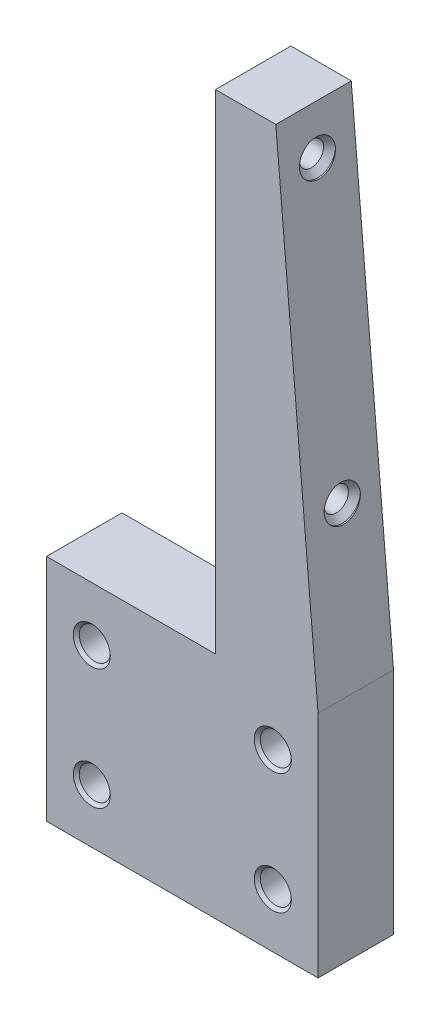
ISO-10303-21;
HEADER;
FILE_DESCRIPTION(('STEP AP214'),'2;1');
FILE_NAME('part.step','',(''),(''),'','','');
FILE_SCHEMA(('AUTOMOTIVE_DESIGN { 1 0 10303 214 1 1 1 1 }'));
ENDSEC;
DATA;
#1=APPLICATION_CONTEXT('core data for automotive mechanical design processes');
#2=APPLICATION_PROTOCOL_DEFINITION('international standard','automotive_design',2000,#1);
#3=PRODUCT_CONTEXT('',#1,'mechanical');
#4=PRODUCT('Part','Part','',(#3));
#5=PRODUCT_RELATED_PRODUCT_CATEGORY('part','',(#4));
#6=PRODUCT_DEFINITION_FORMATION('','',#4);
#7=PRODUCT_DEFINITION_CONTEXT('part definition',#1,'design');
#8=PRODUCT_DEFINITION('design','',#6,#7);
#9=PRODUCT_DEFINITION_SHAPE('','',#8);
#10=(LENGTH_UNIT() NAMED_UNIT(*) SI_UNIT(.MILLI.,.METRE.));
#11=(NAMED_UNIT(*) PLANE_ANGLE_UNIT() SI_UNIT($,.RADIAN.));
#12=(NAMED_UNIT(*) SI_UNIT($,.STERADIAN.) SOLID_ANGLE_UNIT());
#13=UNCERTAINTY_MEASURE_WITH_UNIT(LENGTH_MEASURE(1.E-05),#10,'distance_accuracy_value','');
#14=(GEOMETRIC_REPRESENTATION_CONTEXT(3) GLOBAL_UNCERTAINTY_ASSIGNED_CONTEXT((#13)) GLOBAL_UNIT_ASSIGNED_CONTEXT((#10,
#11,#12)) REPRESENTATION_CONTEXT('',''));
#15=CARTESIAN_POINT('',(0.,0.,0.));
#16=DIRECTION('',(0.,0.,1.));
#17=DIRECTION('',(1.,0.,0.));
#18=AXIS2_PLACEMENT_3D('',#15,#16,#17);
#19=CARTESIAN_POINT('',(0.,-1.27,7.9375));
#20=DIRECTION('',(0.,0.,-1.));
#21=DIRECTION('',(-1.,0.,0.));
#22=AXIS2_PLACEMENT_3D('',#19,#20,#21);
#23=PLANE('',#22);
#24=CARTESIAN_POINT('',(12.065,-12.7,7.9375));
#25=DIRECTION('',(0.,0.,1.));
#26=DIRECTION('',(1.,0.,0.));
#27=AXIS2_PLACEMENT_3D('',#24,#25,#26);
#28=CIRCLE('',#27,3.8989);
#29=CARTESIAN_POINT('',(15.9639,-12.7,7.9375));
#30=VERTEX_POINT('',#29);
#31=EDGE_CURVE('E201',#30,#30,#28,.T.);
#32=ORIENTED_EDGE('',*,*,#31,.F.);
#33=EDGE_LOOP('',(#32));
#34=FACE_BOUND('',#33,.T.);
#35=CARTESIAN_POINT('',(-26.035,-38.1,7.9375));
#36=DIRECTION('',(0.,0.,1.));
#37=DIRECTION('',(1.,0.,0.));
#38=AXIS2_PLACEMENT_3D('',#35,#36,#37);
#39=CIRCLE('',#38,3.8989);
#40=CARTESIAN_POINT('',(-22.1361,-38.1,7.9375));
#41=VERTEX_POINT('',#40);
#42=EDGE_CURVE('E225',#41,#41,#39,.T.);
#43=ORIENTED_EDGE('',*,*,#42,.F.);
#44=EDGE_LOOP('',(#43));
#45=FACE_BOUND('',#44,.T.);
#46=DIRECTION('',(0.,-1.,0.));
#47=VECTOR('',#46,1.);
#48=CARTESIAN_POINT('',(0.,101.6,7.9375));
#49=LINE('',#48,#47);
#50=CARTESIAN_POINT('',(0.,101.6,7.9375));
#51=VERTEX_POINT('',#50);
#52=CARTESIAN_POINT('',(0.,-1.27,7.9375));
#53=VERTEX_POINT('',#52);
#54=EDGE_CURVE('E146',#51,#53,#49,.T.);
#55=ORIENTED_EDGE('',*,*,#54,.T.);
#56=DIRECTION('',(-1.,0.,0.));
#57=VECTOR('',#56,1.);
#58=CARTESIAN_POINT('',(0.,-1.27,7.9375));
#59=LINE('',#58,#57);
#60=CARTESIAN_POINT('',(-35.56,-1.27,7.9375));
#61=VERTEX_POINT('',#60);
#62=EDGE_CURVE('E149',#53,#61,#59,.T.);
#63=ORIENTED_EDGE('',*,*,#62,.T.);
#64=DIRECTION('',(0.,-1.,0.));
#65=VECTOR('',#64,1.);
#66=CARTESIAN_POINT('',(-35.56,-1.27,7.9375));
#67=LINE('',#66,#65);
#68=CARTESIAN_POINT('',(-35.56,-49.53,7.9375));
#69=VERTEX_POINT('',#68);
#70=EDGE_CURVE('E235',#61,#69,#67,.T.);
#71=ORIENTED_EDGE('',*,*,#70,.T.);
#72=DIRECTION('',(1.,0.,0.));
#73=VECTOR('',#72,1.);
#74=CARTESIAN_POINT('',(-35.56,-49.53,7.9375));
#75=LINE('',#74,#73);
#76=CARTESIAN_POINT('',(21.59,-49.53,7.9375));
#77=VERTEX_POINT('',#76);
#78=EDGE_CURVE('E237',#69,#77,#75,.T.);
#79=ORIENTED_EDGE('',*,*,#78,.T.);
#80=DIRECTION('',(0.,1.,0.));
#81=VECTOR('',#80,1.);
#82=CARTESIAN_POINT('',(21.59,-49.53,7.9375));
#83=LINE('',#82,#81);
#84=CARTESIAN_POINT('',(21.59,-1.27,7.9375));
#85=VERTEX_POINT('',#84);
#86=EDGE_CURVE('E239',#77,#85,#83,.T.);
#87=ORIENTED_EDGE('',*,*,#86,.T.);
#88=DIRECTION('',(-0.0860988419783634,0.996286600035344,0.));
#89=VECTOR('',#88,1.);
#90=CARTESIAN_POINT('',(21.59,-1.27,7.9375));
#91=LINE('',#90,#89);
#92=CARTESIAN_POINT('',(12.7,101.6,7.9375));
#93=VERTEX_POINT('',#92);
#94=EDGE_CURVE('E241',#85,#93,#91,.T.);
#95=ORIENTED_EDGE('',*,*,#94,.T.);
#96=DIRECTION('',(-1.,0.,0.));
#97=VECTOR('',#96,1.);
#98=CARTESIAN_POINT('',(12.7,101.6,7.9375));
#99=LINE('',#98,#97);
#100=EDGE_CURVE('E139',#93,#51,#99,.T.);
#101=ORIENTED_EDGE('',*,*,#100,.T.);
#102=EDGE_LOOP('',(#55,#63,#71,#79,#87,#95,#101));
#103=FACE_BOUND('',#102,.T.);
#104=CARTESIAN_POINT('',(12.065,-38.1,7.9375));
#105=DIRECTION('',(0.,0.,1.));
#106=DIRECTION('',(1.,0.,0.));
#107=AXIS2_PLACEMENT_3D('',#104,#105,#106);
#108=CIRCLE('',#107,3.8989);
#109=CARTESIAN_POINT('',(15.9639,-38.1,7.9375));
#110=VERTEX_POINT('',#109);
#111=EDGE_CURVE('E213',#110,#110,#108,.T.);
#112=ORIENTED_EDGE('',*,*,#111,.F.);
#113=EDGE_LOOP('',(#112));
#114=FACE_BOUND('',#113,.T.);
#115=CARTESIAN_POINT('',(-26.035,-12.7,7.9375));
#116=DIRECTION('',(0.,0.,1.));
#117=DIRECTION('',(1.,0.,0.));
#118=AXIS2_PLACEMENT_3D('',#115,#116,#117);
#119=CIRCLE('',#118,3.8989);
#120=CARTESIAN_POINT('',(-22.1361,-12.7,7.9375));
#121=VERTEX_POINT('',#120);
#122=EDGE_CURVE('E189',#121,#121,#119,.T.);
#123=ORIENTED_EDGE('',*,*,#122,.F.);
#124=EDGE_LOOP('',(#123));
#125=FACE_BOUND('',#124,.T.);
#126=ADVANCED_FACE('F34',(#34,#45,#103,#114,#125),#23,.F.);
#127=CARTESIAN_POINT('',(0.,101.6,7.9375));
#128=DIRECTION('',(1.,0.,0.));
#129=DIRECTION('',(0.,1.,0.));
#130=AXIS2_PLACEMENT_3D('',#127,#128,#129);
#131=PLANE('',#130);
#132=CARTESIAN_POINT('',(0.,92.075,0.));
#133=DIRECTION('',(-1.,0.,0.));
#134=DIRECTION('',(0.,0.,1.));
#135=AXIS2_PLACEMENT_3D('',#132,#133,#134);
#136=CIRCLE('',#135,3.80999999999999);
#137=CARTESIAN_POINT('',(0.,92.075,3.80999999999999));
#138=VERTEX_POINT('',#137);
#139=EDGE_CURVE('E108',#138,#138,#136,.T.);
#140=ORIENTED_EDGE('',*,*,#139,.F.);
#141=EDGE_LOOP('',(#140));
#142=FACE_BOUND('',#141,.T.);
#143=CARTESIAN_POINT('',(0.,31.75,0.));
#144=DIRECTION('',(-1.,0.,0.));
#145=DIRECTION('',(0.,0.,1.));
#146=AXIS2_PLACEMENT_3D('',#143,#144,#145);
#147=CIRCLE('',#146,3.81);
#148=CARTESIAN_POINT('',(0.,31.75,3.81000000000001));
#149=VERTEX_POINT('',#148);
#150=EDGE_CURVE('E170',#149,#149,#147,.T.);
#151=ORIENTED_EDGE('',*,*,#150,.F.);
#152=EDGE_LOOP('',(#151));
#153=FACE_BOUND('',#152,.T.);
#154=DIRECTION('',(0.,-1.,0.));
#155=VECTOR('',#154,1.);
#156=CARTESIAN_POINT('',(0.,101.6,-7.9375));
#157=LINE('',#156,#155);
#158=CARTESIAN_POINT('',(0.,101.6,-7.9375));
#159=VERTEX_POINT('',#158);
#160=CARTESIAN_POINT('',(0.,-1.27,-7.9375));
#161=VERTEX_POINT('',#160);
#162=EDGE_CURVE('E145',#159,#161,#157,.T.);
#163=ORIENTED_EDGE('',*,*,#162,.T.);
#164=DIRECTION('',(0.,0.,-1.));
#165=VECTOR('',#164,1.);
#166=CARTESIAN_POINT('',(0.,-1.27,7.9375));
#167=LINE('',#166,#165);
#168=EDGE_CURVE('E164',#53,#161,#167,.T.);
#169=ORIENTED_EDGE('',*,*,#168,.F.);
#170=ORIENTED_EDGE('',*,*,#54,.F.);
#171=DIRECTION('',(0.,0.,-1.));
#172=VECTOR('',#171,1.);
#173=CARTESIAN_POINT('',(0.,101.6,7.9375));
#174=LINE('',#173,#172);
#175=EDGE_CURVE('E140',#51,#159,#174,.T.);
#176=ORIENTED_EDGE('',*,*,#175,.T.);
#177=EDGE_LOOP('',(#163,#169,#170,#176));
#178=FACE_BOUND('',#177,.T.);
#179=ADVANCED_FACE('F36',(#142,#153,#178),#131,.F.);
#180=CARTESIAN_POINT('',(0.,-1.27,7.9375));
#181=DIRECTION('',(0.,-1.,0.));
#182=DIRECTION('',(1.,0.,0.));
#183=AXIS2_PLACEMENT_3D('',#180,#181,#182);
#184=PLANE('',#183);
#185=DIRECTION('',(-1.,0.,0.));
#186=VECTOR('',#185,1.);
#187=CARTESIAN_POINT('',(0.,-1.27,-7.9375));
#188=LINE('',#187,#186);
#189=CARTESIAN_POINT('',(-35.56,-1.27,-7.9375));
#190=VERTEX_POINT('',#189);
#191=EDGE_CURVE('E245',#161,#190,#188,.T.);
#192=ORIENTED_EDGE('',*,*,#191,.T.);
#193=DIRECTION('',(0.,0.,-1.));
#194=VECTOR('',#193,1.);
#195=CARTESIAN_POINT('',(-35.56,-1.27,7.9375));
#196=LINE('',#195,#194);
#197=EDGE_CURVE('E161',#61,#190,#196,.T.);
#198=ORIENTED_EDGE('',*,*,#197,.F.);
#199=ORIENTED_EDGE('',*,*,#62,.F.);
#200=ORIENTED_EDGE('',*,*,#168,.T.);
#201=EDGE_LOOP('',(#192,#198,#199,#200));
#202=FACE_BOUND('',#201,.T.);
#203=ADVANCED_FACE('F264',(#202),#184,.F.);
#204=CARTESIAN_POINT('',(-35.56,-1.27,7.9375));
#205=DIRECTION('',(1.,0.,0.));
#206=DIRECTION('',(0.,0.,-1.));
#207=AXIS2_PLACEMENT_3D('',#204,#205,#206);
#208=PLANE('',#207);
#209=DIRECTION('',(0.,-1.,0.));
#210=VECTOR('',#209,1.);
#211=CARTESIAN_POINT('',(-35.56,-1.27,-7.9375));
#212=LINE('',#211,#210);
#213=CARTESIAN_POINT('',(-35.56,-49.53,-7.9375));
#214=VERTEX_POINT('',#213);
#215=EDGE_CURVE('E247',#190,#214,#212,.T.);
#216=ORIENTED_EDGE('',*,*,#215,.T.);
#217=DIRECTION('',(0.,0.,-1.));
#218=VECTOR('',#217,1.);
#219=CARTESIAN_POINT('',(-35.56,-49.53,7.9375));
#220=LINE('',#219,#218);
#221=EDGE_CURVE('E158',#69,#214,#220,.T.);
#222=ORIENTED_EDGE('',*,*,#221,.F.);
#223=ORIENTED_EDGE('',*,*,#70,.F.);
#224=ORIENTED_EDGE('',*,*,#197,.T.);
#225=EDGE_LOOP('',(#216,#222,#223,#224));
#226=FACE_BOUND('',#225,.T.);
#227=ADVANCED_FACE('F261',(#226),#208,.F.);
#228=CARTESIAN_POINT('',(-35.56,-49.53,7.9375));
#229=DIRECTION('',(0.,1.,0.));
#230=DIRECTION('',(0.,0.,1.));
#231=AXIS2_PLACEMENT_3D('',#228,#229,#230);
#232=PLANE('',#231);
#233=DIRECTION('',(1.,0.,0.));
#234=VECTOR('',#233,1.);
#235=CARTESIAN_POINT('',(-35.56,-49.53,-7.9375));
#236=LINE('',#235,#234);
#237=CARTESIAN_POINT('',(21.59,-49.53,-7.9375));
#238=VERTEX_POINT('',#237);
#239=EDGE_CURVE('E249',#214,#238,#236,.T.);
#240=ORIENTED_EDGE('',*,*,#239,.T.);
#241=DIRECTION('',(0.,0.,-1.));
#242=VECTOR('',#241,1.);
#243=CARTESIAN_POINT('',(21.59,-49.53,7.9375));
#244=LINE('',#243,#242);
#245=EDGE_CURVE('E155',#77,#238,#244,.T.);
#246=ORIENTED_EDGE('',*,*,#245,.F.);
#247=ORIENTED_EDGE('',*,*,#78,.F.);
#248=ORIENTED_EDGE('',*,*,#221,.T.);
#249=EDGE_LOOP('',(#240,#246,#247,#248));
#250=FACE_BOUND('',#249,.T.);
#251=ADVANCED_FACE('F256',(#250),#232,.F.);
#252=CARTESIAN_POINT('',(21.59,-49.53,7.9375));
#253=DIRECTION('',(-1.,0.,0.));
#254=DIRECTION('',(0.,0.,1.));
#255=AXIS2_PLACEMENT_3D('',#252,#253,#254);
#256=PLANE('',#255);
#257=DIRECTION('',(0.,1.,0.));
#258=VECTOR('',#257,1.);
#259=CARTESIAN_POINT('',(21.59,-49.53,-7.9375));
#260=LINE('',#259,#258);
#261=CARTESIAN_POINT('',(21.59,-1.27,-7.9375));
#262=VERTEX_POINT('',#261);
#263=EDGE_CURVE('E134',#238,#262,#260,.T.);
#264=ORIENTED_EDGE('',*,*,#263,.T.);
#265=DIRECTION('',(0.,0.,-1.));
#266=VECTOR('',#265,1.);
#267=CARTESIAN_POINT('',(21.59,-1.27,7.9375));
#268=LINE('',#267,#266);
#269=EDGE_CURVE('E129',#85,#262,#268,.T.);
#270=ORIENTED_EDGE('',*,*,#269,.F.);
#271=ORIENTED_EDGE('',*,*,#86,.F.);
#272=ORIENTED_EDGE('',*,*,#245,.T.);
#273=EDGE_LOOP('',(#264,#270,#271,#272));
#274=FACE_BOUND('',#273,.T.);
#275=ADVANCED_FACE('F114',(#274),#256,.F.);
#276=CARTESIAN_POINT('',(21.59,-1.27,7.9375));
#277=DIRECTION('',(-0.996286600035344,-0.0860988419783634,0.));
#278=DIRECTION('',(0.0860988419783634,-0.996286600035344,0.));
#279=AXIS2_PLACEMENT_3D('',#276,#277,#278);
#280=PLANE('',#279);
#281=CARTESIAN_POINT('',(13.5231481481482,92.075,0.));
#282=DIRECTION('',(-0.996286600035344,-0.0860988419783634,0.));
#283=DIRECTION('',(-0.0860988419783634,0.996286600035344,0.));
#284=AXIS2_PLACEMENT_3D('',#281,#282,#283);
#285=ELLIPSE('',#284,3.82420078706753,3.80999999999999);
#286=CARTESIAN_POINT('',(13.5231481481482,92.075,-3.80999999999999));
#287=VERTEX_POINT('',#286);
#288=CARTESIAN_POINT('',(13.5231481481482,92.075,3.80999999999999));
#289=VERTEX_POINT('',#288);
#290=EDGE_CURVE('E42',#287,#289,#285,.T.);
#291=ORIENTED_EDGE('',*,*,#290,.T.);
#292=CARTESIAN_POINT('',(13.5518167599418,91.7432632063882,0.));
#293=DIRECTION('',(-0.996286600035344,-0.0860988419783634,0.));
#294=DIRECTION('',(0.0860988419783633,-0.996286600035344,0.));
#295=AXIS2_PLACEMENT_3D('',#292,#293,#294);
#296=ELLIPSE('',#295,3.85297625367783,3.82430744199961);
#297=EDGE_CURVE('E11',#289,#287,#296,.T.);
#298=ORIENTED_EDGE('',*,*,#297,.T.);
#299=EDGE_LOOP('',(#291,#298));
#300=FACE_BOUND('',#299,.T.);
#301=CARTESIAN_POINT('',(18.7650883648801,31.4182632063882,0.));
#302=DIRECTION('',(-0.996286600035344,-0.0860988419783634,0.));
#303=DIRECTION('',(0.0860988419783633,-0.996286600035344,0.));
#304=AXIS2_PLACEMENT_3D('',#301,#302,#303);
#305=ELLIPSE('',#304,3.85297625367783,3.82430744199961);
#306=CARTESIAN_POINT('',(18.7364197530864,31.75,3.81));
#307=VERTEX_POINT('',#306);
#308=CARTESIAN_POINT('',(18.7364197530864,31.75,-3.80999999999999));
#309=VERTEX_POINT('',#308);
#310=EDGE_CURVE('E119',#307,#309,#305,.T.);
#311=ORIENTED_EDGE('',*,*,#310,.T.);
#312=CARTESIAN_POINT('',(18.7364197530864,31.75,0.));
#313=DIRECTION('',(-0.996286600035344,-0.0860988419783634,0.));
#314=DIRECTION('',(-0.0860988419783634,0.996286600035344,0.));
#315=AXIS2_PLACEMENT_3D('',#312,#313,#314);
#316=ELLIPSE('',#315,3.82420078706753,3.80999999999999);
#317=EDGE_CURVE('E105',#309,#307,#316,.T.);
#318=ORIENTED_EDGE('',*,*,#317,.T.);
#319=EDGE_LOOP('',(#311,#318));
#320=FACE_BOUND('',#319,.T.);
#321=DIRECTION('',(-0.0860988419783634,0.996286600035344,0.));
#322=VECTOR('',#321,1.);
#323=CARTESIAN_POINT('',(21.59,-1.27,-7.9375));
#324=LINE('',#323,#322);
#325=CARTESIAN_POINT('',(12.7,101.6,-7.9375));
#326=VERTEX_POINT('',#325);
#327=EDGE_CURVE('E123',#262,#326,#324,.T.);
#328=ORIENTED_EDGE('',*,*,#327,.T.);
#329=DIRECTION('',(0.,0.,-1.));
#330=VECTOR('',#329,1.);
#331=CARTESIAN_POINT('',(12.7,101.6,7.9375));
#332=LINE('',#331,#330);
#333=EDGE_CURVE('E126',#93,#326,#332,.T.);
#334=ORIENTED_EDGE('',*,*,#333,.F.);
#335=ORIENTED_EDGE('',*,*,#94,.F.);
#336=ORIENTED_EDGE('',*,*,#269,.T.);
#337=EDGE_LOOP('',(#328,#334,#335,#336));
#338=FACE_BOUND('',#337,.T.);
#339=ADVANCED_FACE('F110',(#300,#320,#338),#280,.F.);
#340=CARTESIAN_POINT('',(12.7,101.6,7.9375));
#341=DIRECTION('',(0.,-1.,0.));
#342=DIRECTION('',(0.,0.,-1.));
#343=AXIS2_PLACEMENT_3D('',#340,#341,#342);
#344=PLANE('',#343);
#345=DIRECTION('',(-1.,0.,0.));
#346=VECTOR('',#345,1.);
#347=CARTESIAN_POINT('',(12.7,101.6,-7.9375));
#348=LINE('',#347,#346);
#349=EDGE_CURVE('E133',#326,#159,#348,.T.);
#350=ORIENTED_EDGE('',*,*,#349,.T.);
#351=ORIENTED_EDGE('',*,*,#175,.F.);
#352=ORIENTED_EDGE('',*,*,#100,.F.);
#353=ORIENTED_EDGE('',*,*,#333,.T.);
#354=EDGE_LOOP('',(#350,#351,#352,#353));
#355=FACE_BOUND('',#354,.T.);
#356=ADVANCED_FACE('F113',(#355),#344,.F.);
#357=CARTESIAN_POINT('',(0.,-1.27,-7.9375));
#358=DIRECTION('',(0.,0.,-1.));
#359=DIRECTION('',(-1.,0.,0.));
#360=AXIS2_PLACEMENT_3D('',#357,#358,#359);
#361=PLANE('',#360);
#362=CARTESIAN_POINT('',(-26.035,-12.7,-7.9375));
#363=DIRECTION('',(0.,0.,1.));
#364=DIRECTION('',(1.,0.,0.));
#365=AXIS2_PLACEMENT_3D('',#362,#363,#364);
#366=CIRCLE('',#365,3.8989);
#367=CARTESIAN_POINT('',(-22.1361,-12.7,-7.9375));
#368=VERTEX_POINT('',#367);
#369=EDGE_CURVE('E186',#368,#368,#366,.T.);
#370=ORIENTED_EDGE('',*,*,#369,.T.);
#371=EDGE_LOOP('',(#370));
#372=FACE_BOUND('',#371,.T.);
#373=CARTESIAN_POINT('',(12.065,-12.7,-7.9375));
#374=DIRECTION('',(0.,0.,1.));
#375=DIRECTION('',(1.,0.,0.));
#376=AXIS2_PLACEMENT_3D('',#373,#374,#375);
#377=CIRCLE('',#376,3.89889999999999);
#378=CARTESIAN_POINT('',(15.9639,-12.7,-7.9375));
#379=VERTEX_POINT('',#378);
#380=EDGE_CURVE('E198',#379,#379,#377,.T.);
#381=ORIENTED_EDGE('',*,*,#380,.T.);
#382=EDGE_LOOP('',(#381));
#383=FACE_BOUND('',#382,.T.);
#384=CARTESIAN_POINT('',(12.065,-38.1,-7.9375));
#385=DIRECTION('',(0.,0.,1.));
#386=DIRECTION('',(1.,0.,0.));
#387=AXIS2_PLACEMENT_3D('',#384,#385,#386);
#388=CIRCLE('',#387,3.89889999999999);
#389=CARTESIAN_POINT('',(15.9639,-38.1,-7.9375));
#390=VERTEX_POINT('',#389);
#391=EDGE_CURVE('E210',#390,#390,#388,.T.);
#392=ORIENTED_EDGE('',*,*,#391,.T.);
#393=EDGE_LOOP('',(#392));
#394=FACE_BOUND('',#393,.T.);
#395=CARTESIAN_POINT('',(-26.035,-38.1,-7.9375));
#396=DIRECTION('',(0.,0.,1.));
#397=DIRECTION('',(1.,0.,0.));
#398=AXIS2_PLACEMENT_3D('',#395,#396,#397);
#399=CIRCLE('',#398,3.8989);
#400=CARTESIAN_POINT('',(-22.1361,-38.1,-7.9375));
#401=VERTEX_POINT('',#400);
#402=EDGE_CURVE('E222',#401,#401,#399,.T.);
#403=ORIENTED_EDGE('',*,*,#402,.T.);
#404=EDGE_LOOP('',(#403));
#405=FACE_BOUND('',#404,.T.);
#406=ORIENTED_EDGE('',*,*,#162,.F.);
#407=ORIENTED_EDGE('',*,*,#349,.F.);
#408=ORIENTED_EDGE('',*,*,#327,.F.);
#409=ORIENTED_EDGE('',*,*,#263,.F.);
#410=ORIENTED_EDGE('',*,*,#239,.F.);
#411=ORIENTED_EDGE('',*,*,#215,.F.);
#412=ORIENTED_EDGE('',*,*,#191,.F.);
#413=EDGE_LOOP('',(#406,#407,#408,#409,#410,#411,#412));
#414=FACE_BOUND('',#413,.T.);
#415=ADVANCED_FACE('F143',(#372,#383,#394,#405,#414),#361,.T.);
#416=CARTESIAN_POINT('',(-26.035,-38.1,-7.3025));
#417=DIRECTION('',(0.,0.,-1.));
#418=DIRECTION('',(-1.,0.,0.));
#419=AXIS2_PLACEMENT_3D('',#416,#417,#418);
#420=CONICAL_SURFACE('',#419,3.2639,0.78539816339745);
#421=ORIENTED_EDGE('',*,*,#402,.F.);
#422=EDGE_LOOP('',(#421));
#423=FACE_BOUND('',#422,.T.);
#424=CARTESIAN_POINT('',(-26.035,-38.1,-7.3025));
#425=DIRECTION('',(0.,0.,1.));
#426=DIRECTION('',(1.,0.,0.));
#427=AXIS2_PLACEMENT_3D('',#424,#425,#426);
#428=CIRCLE('',#427,3.2639);
#429=CARTESIAN_POINT('',(-22.7711,-38.1,-7.3025));
#430=VERTEX_POINT('',#429);
#431=EDGE_CURVE('E231',#430,#430,#428,.T.);
#432=ORIENTED_EDGE('',*,*,#431,.T.);
#433=EDGE_LOOP('',(#432));
#434=FACE_BOUND('',#433,.T.);
#435=ADVANCED_FACE('F329',(#423,#434),#420,.F.);
#436=CARTESIAN_POINT('',(-26.035,-38.1,7.9375));
#437=DIRECTION('',(0.,0.,1.));
#438=DIRECTION('',(1.,0.,0.));
#439=AXIS2_PLACEMENT_3D('',#436,#437,#438);
#440=CYLINDRICAL_SURFACE('',#439,3.2639);
#441=ORIENTED_EDGE('',*,*,#431,.F.);
#442=EDGE_LOOP('',(#441));
#443=FACE_BOUND('',#442,.T.);
#444=CARTESIAN_POINT('',(-26.035,-38.1,7.3025));
#445=DIRECTION('',(0.,0.,1.));
#446=DIRECTION('',(1.,0.,0.));
#447=AXIS2_PLACEMENT_3D('',#444,#445,#446);
#448=CIRCLE('',#447,3.2639);
#449=CARTESIAN_POINT('',(-22.7711,-38.1,7.3025));
#450=VERTEX_POINT('',#449);
#451=EDGE_CURVE('E228',#450,#450,#448,.T.);
#452=ORIENTED_EDGE('',*,*,#451,.T.);
#453=EDGE_LOOP('',(#452));
#454=FACE_BOUND('',#453,.T.);
#455=ADVANCED_FACE('F325',(#443,#454),#440,.F.);
#456=CARTESIAN_POINT('',(-26.035,-38.1,7.9375));
#457=DIRECTION('',(0.,0.,1.));
#458=DIRECTION('',(1.,0.,0.));
#459=AXIS2_PLACEMENT_3D('',#456,#457,#458);
#460=CONICAL_SURFACE('',#459,3.8989,0.785398163397447);
#461=ORIENTED_EDGE('',*,*,#451,.F.);
#462=EDGE_LOOP('',(#461));
#463=FACE_BOUND('',#462,.T.);
#464=ORIENTED_EDGE('',*,*,#42,.T.);
#465=EDGE_LOOP('',(#464));
#466=FACE_BOUND('',#465,.T.);
#467=ADVANCED_FACE('F321',(#463,#466),#460,.F.);
#468=CARTESIAN_POINT('',(12.065,-38.1,-7.3025));
#469=DIRECTION('',(0.,0.,-1.));
#470=DIRECTION('',(-1.,0.,0.));
#471=AXIS2_PLACEMENT_3D('',#468,#469,#470);
#472=CONICAL_SURFACE('',#471,3.2639,0.785398163397448);
#473=ORIENTED_EDGE('',*,*,#391,.F.);
#474=EDGE_LOOP('',(#473));
#475=FACE_BOUND('',#474,.T.);
#476=CARTESIAN_POINT('',(12.065,-38.1,-7.3025));
#477=DIRECTION('',(0.,0.,1.));
#478=DIRECTION('',(1.,0.,0.));
#479=AXIS2_PLACEMENT_3D('',#476,#477,#478);
#480=CIRCLE('',#479,3.2639);
#481=CARTESIAN_POINT('',(15.3289,-38.1,-7.3025));
#482=VERTEX_POINT('',#481);
#483=EDGE_CURVE('E219',#482,#482,#480,.T.);
#484=ORIENTED_EDGE('',*,*,#483,.T.);
#485=EDGE_LOOP('',(#484));
#486=FACE_BOUND('',#485,.T.);
#487=ADVANCED_FACE('F317',(#475,#486),#472,.F.);
#488=CARTESIAN_POINT('',(12.065,-38.1,7.9375));
#489=DIRECTION('',(0.,0.,1.));
#490=DIRECTION('',(1.,0.,0.));
#491=AXIS2_PLACEMENT_3D('',#488,#489,#490);
#492=CYLINDRICAL_SURFACE('',#491,3.2639);
#493=ORIENTED_EDGE('',*,*,#483,.F.);
#494=EDGE_LOOP('',(#493));
#495=FACE_BOUND('',#494,.T.);
#496=CARTESIAN_POINT('',(12.065,-38.1,7.3025));
#497=DIRECTION('',(0.,0.,1.));
#498=DIRECTION('',(1.,0.,0.));
#499=AXIS2_PLACEMENT_3D('',#496,#497,#498);
#500=CIRCLE('',#499,3.2639);
#501=CARTESIAN_POINT('',(15.3289,-38.1,7.3025));
#502=VERTEX_POINT('',#501);
#503=EDGE_CURVE('E216',#502,#502,#500,.T.);
#504=ORIENTED_EDGE('',*,*,#503,.T.);
#505=EDGE_LOOP('',(#504));
#506=FACE_BOUND('',#505,.T.);
#507=ADVANCED_FACE('F313',(#495,#506),#492,.F.);
#508=CARTESIAN_POINT('',(12.065,-38.1,7.9375));
#509=DIRECTION('',(0.,0.,1.));
#510=DIRECTION('',(1.,0.,0.));
#511=AXIS2_PLACEMENT_3D('',#508,#509,#510);
#512=CONICAL_SURFACE('',#511,3.8989,0.785398163397447);
#513=ORIENTED_EDGE('',*,*,#503,.F.);
#514=EDGE_LOOP('',(#513));
#515=FACE_BOUND('',#514,.T.);
#516=ORIENTED_EDGE('',*,*,#111,.T.);
#517=EDGE_LOOP('',(#516));
#518=FACE_BOUND('',#517,.T.);
#519=ADVANCED_FACE('F309',(#515,#518),#512,.F.);
#520=CARTESIAN_POINT('',(12.065,-12.7,-7.3025));
#521=DIRECTION('',(0.,0.,-1.));
#522=DIRECTION('',(-1.,0.,0.));
#523=AXIS2_PLACEMENT_3D('',#520,#521,#522);
#524=CONICAL_SURFACE('',#523,3.2639,0.785398163397448);
#525=ORIENTED_EDGE('',*,*,#380,.F.);
#526=EDGE_LOOP('',(#525));
#527=FACE_BOUND('',#526,.T.);
#528=CARTESIAN_POINT('',(12.065,-12.7,-7.3025));
#529=DIRECTION('',(0.,0.,1.));
#530=DIRECTION('',(1.,0.,0.));
#531=AXIS2_PLACEMENT_3D('',#528,#529,#530);
#532=CIRCLE('',#531,3.2639);
#533=CARTESIAN_POINT('',(15.3289,-12.7,-7.3025));
#534=VERTEX_POINT('',#533);
#535=EDGE_CURVE('E207',#534,#534,#532,.T.);
#536=ORIENTED_EDGE('',*,*,#535,.T.);
#537=EDGE_LOOP('',(#536));
#538=FACE_BOUND('',#537,.T.);
#539=ADVANCED_FACE('F305',(#527,#538),#524,.F.);
#540=CARTESIAN_POINT('',(12.065,-12.7,7.9375));
#541=DIRECTION('',(0.,0.,1.));
#542=DIRECTION('',(1.,0.,0.));
#543=AXIS2_PLACEMENT_3D('',#540,#541,#542);
#544=CYLINDRICAL_SURFACE('',#543,3.2639);
#545=ORIENTED_EDGE('',*,*,#535,.F.);
#546=EDGE_LOOP('',(#545));
#547=FACE_BOUND('',#546,.T.);
#548=CARTESIAN_POINT('',(12.065,-12.7,7.3025));
#549=DIRECTION('',(0.,0.,1.));
#550=DIRECTION('',(1.,0.,0.));
#551=AXIS2_PLACEMENT_3D('',#548,#549,#550);
#552=CIRCLE('',#551,3.2639);
#553=CARTESIAN_POINT('',(15.3289,-12.7,7.3025));
#554=VERTEX_POINT('',#553);
#555=EDGE_CURVE('E204',#554,#554,#552,.T.);
#556=ORIENTED_EDGE('',*,*,#555,.T.);
#557=EDGE_LOOP('',(#556));
#558=FACE_BOUND('',#557,.T.);
#559=ADVANCED_FACE('F301',(#547,#558),#544,.F.);
#560=CARTESIAN_POINT('',(12.065,-12.7,7.9375));
#561=DIRECTION('',(0.,0.,1.));
#562=DIRECTION('',(1.,0.,0.));
#563=AXIS2_PLACEMENT_3D('',#560,#561,#562);
#564=CONICAL_SURFACE('',#563,3.8989,0.785398163397447);
#565=ORIENTED_EDGE('',*,*,#555,.F.);
#566=EDGE_LOOP('',(#565));
#567=FACE_BOUND('',#566,.T.);
#568=ORIENTED_EDGE('',*,*,#31,.T.);
#569=EDGE_LOOP('',(#568));
#570=FACE_BOUND('',#569,.T.);
#571=ADVANCED_FACE('F297',(#567,#570),#564,.F.);
#572=CARTESIAN_POINT('',(-26.035,-12.7,-7.3025));
#573=DIRECTION('',(0.,0.,-1.));
#574=DIRECTION('',(-1.,0.,0.));
#575=AXIS2_PLACEMENT_3D('',#572,#573,#574);
#576=CONICAL_SURFACE('',#575,3.2639,0.78539816339745);
#577=ORIENTED_EDGE('',*,*,#369,.F.);
#578=EDGE_LOOP('',(#577));
#579=FACE_BOUND('',#578,.T.);
#580=CARTESIAN_POINT('',(-26.035,-12.7,-7.3025));
#581=DIRECTION('',(0.,0.,1.));
#582=DIRECTION('',(1.,0.,0.));
#583=AXIS2_PLACEMENT_3D('',#580,#581,#582);
#584=CIRCLE('',#583,3.2639);
#585=CARTESIAN_POINT('',(-22.7711,-12.7,-7.3025));
#586=VERTEX_POINT('',#585);
#587=EDGE_CURVE('E195',#586,#586,#584,.T.);
#588=ORIENTED_EDGE('',*,*,#587,.T.);
#589=EDGE_LOOP('',(#588));
#590=FACE_BOUND('',#589,.T.);
#591=ADVANCED_FACE('F288',(#579,#590),#576,.F.);
#592=CARTESIAN_POINT('',(-26.035,-12.7,7.9375));
#593=DIRECTION('',(0.,0.,1.));
#594=DIRECTION('',(1.,0.,0.));
#595=AXIS2_PLACEMENT_3D('',#592,#593,#594);
#596=CYLINDRICAL_SURFACE('',#595,3.2639);
#597=ORIENTED_EDGE('',*,*,#587,.F.);
#598=EDGE_LOOP('',(#597));
#599=FACE_BOUND('',#598,.T.);
#600=CARTESIAN_POINT('',(-26.035,-12.7,7.3025));
#601=DIRECTION('',(0.,0.,1.));
#602=DIRECTION('',(1.,0.,0.));
#603=AXIS2_PLACEMENT_3D('',#600,#601,#602);
#604=CIRCLE('',#603,3.2639);
#605=CARTESIAN_POINT('',(-22.7711,-12.7,7.3025));
#606=VERTEX_POINT('',#605);
#607=EDGE_CURVE('E192',#606,#606,#604,.T.);
#608=ORIENTED_EDGE('',*,*,#607,.T.);
#609=EDGE_LOOP('',(#608));
#610=FACE_BOUND('',#609,.T.);
#611=ADVANCED_FACE('F279',(#599,#610),#596,.F.);
#612=CARTESIAN_POINT('',(-26.035,-12.7,7.9375));
#613=DIRECTION('',(0.,0.,1.));
#614=DIRECTION('',(1.,0.,0.));
#615=AXIS2_PLACEMENT_3D('',#612,#613,#614);
#616=CONICAL_SURFACE('',#615,3.8989,0.785398163397447);
#617=ORIENTED_EDGE('',*,*,#607,.F.);
#618=EDGE_LOOP('',(#617));
#619=FACE_BOUND('',#618,.T.);
#620=ORIENTED_EDGE('',*,*,#122,.T.);
#621=EDGE_LOOP('',(#620));
#622=FACE_BOUND('',#621,.T.);
#623=ADVANCED_FACE('F277',(#619,#622),#616,.F.);
#624=CARTESIAN_POINT('',(18.7364197530864,31.75,0.));
#625=DIRECTION('',(-1.,0.,0.));
#626=DIRECTION('',(0.,0.,1.));
#627=AXIS2_PLACEMENT_3D('',#624,#625,#626);
#628=CYLINDRICAL_SURFACE('',#627,3.80999999999999);
#629=CARTESIAN_POINT('',(18.7364197530864,31.75,0.));
#630=DIRECTION('',(-1.,0.,0.));
#631=DIRECTION('',(0.,0.,1.));
#632=AXIS2_PLACEMENT_3D('',#629,#630,#631);
#633=CIRCLE('',#632,3.80999999999999);
#634=EDGE_CURVE('E55',#309,#307,#633,.T.);
#635=ORIENTED_EDGE('',*,*,#634,.T.);
#636=ORIENTED_EDGE('',*,*,#317,.F.);
#637=EDGE_LOOP('',(#635,#636));
#638=FACE_BOUND('',#637,.T.);
#639=ADVANCED_FACE('F169',(#638),#628,.F.);
#640=CARTESIAN_POINT('',(17.4791197530864,31.75,0.));
#641=DIRECTION('',(1.,0.,0.));
#642=DIRECTION('',(0.,0.,-1.));
#643=AXIS2_PLACEMENT_3D('',#640,#641,#642);
#644=CONICAL_SURFACE('',#643,2.5527,0.785398163397447);
#645=CARTESIAN_POINT('',(17.4791197530864,31.75,0.));
#646=DIRECTION('',(-1.,0.,0.));
#647=DIRECTION('',(0.,0.,1.));
#648=AXIS2_PLACEMENT_3D('',#645,#646,#647);
#649=CIRCLE('',#648,2.5527);
#650=CARTESIAN_POINT('',(17.4791197530864,31.75,2.55270000000001));
#651=VERTEX_POINT('',#650);
#652=EDGE_CURVE('E183',#651,#651,#649,.T.);
#653=ORIENTED_EDGE('',*,*,#652,.T.);
#654=EDGE_LOOP('',(#653));
#655=FACE_BOUND('',#654,.T.);
#656=ORIENTED_EDGE('',*,*,#634,.F.);
#657=ORIENTED_EDGE('',*,*,#310,.F.);
#658=EDGE_LOOP('',(#656,#657));
#659=FACE_BOUND('',#658,.T.);
#660=ADVANCED_FACE('F286',(#655,#659),#644,.F.);
#661=CARTESIAN_POINT('',(0.,31.75,0.));
#662=DIRECTION('',(-1.,0.,0.));
#663=DIRECTION('',(0.,0.,1.));
#664=AXIS2_PLACEMENT_3D('',#661,#662,#663);
#665=CYLINDRICAL_SURFACE('',#664,2.5527);
#666=ORIENTED_EDGE('',*,*,#652,.F.);
#667=EDGE_LOOP('',(#666));
#668=FACE_BOUND('',#667,.T.);
#669=CARTESIAN_POINT('',(1.2573,31.75,0.));
#670=DIRECTION('',(-1.,0.,0.));
#671=DIRECTION('',(0.,0.,1.));
#672=AXIS2_PLACEMENT_3D('',#669,#670,#671);
#673=CIRCLE('',#672,2.5527);
#674=CARTESIAN_POINT('',(1.2573,31.75,2.55270000000001));
#675=VERTEX_POINT('',#674);
#676=EDGE_CURVE('E174',#675,#675,#673,.T.);
#677=ORIENTED_EDGE('',*,*,#676,.T.);
#678=EDGE_LOOP('',(#677));
#679=FACE_BOUND('',#678,.T.);
#680=ADVANCED_FACE('F358',(#668,#679),#665,.F.);
#681=CARTESIAN_POINT('',(0.,31.75,0.));
#682=DIRECTION('',(-1.,0.,0.));
#683=DIRECTION('',(0.,0.,1.));
#684=AXIS2_PLACEMENT_3D('',#681,#682,#683);
#685=CONICAL_SURFACE('',#684,3.81,0.785398163397449);
#686=ORIENTED_EDGE('',*,*,#676,.F.);
#687=EDGE_LOOP('',(#686));
#688=FACE_BOUND('',#687,.T.);
#689=ORIENTED_EDGE('',*,*,#150,.T.);
#690=EDGE_LOOP('',(#689));
#691=FACE_BOUND('',#690,.T.);
#692=ADVANCED_FACE('F356',(#688,#691),#685,.F.);
#693=CARTESIAN_POINT('',(12.2658481481482,92.075,0.));
#694=DIRECTION('',(1.,0.,0.));
#695=DIRECTION('',(0.,0.,-1.));
#696=AXIS2_PLACEMENT_3D('',#693,#694,#695);
#697=CONICAL_SURFACE('',#696,2.55269999999999,0.78539816339745);
#698=CARTESIAN_POINT('',(12.2658481481482,92.075,0.));
#699=DIRECTION('',(-1.,0.,0.));
#700=DIRECTION('',(0.,0.,1.));
#701=AXIS2_PLACEMENT_3D('',#698,#699,#700);
#702=CIRCLE('',#701,2.55269999999999);
#703=CARTESIAN_POINT('',(12.2658481481482,92.075,2.55269999999999));
#704=VERTEX_POINT('',#703);
#705=EDGE_CURVE('E171',#704,#704,#702,.T.);
#706=ORIENTED_EDGE('',*,*,#705,.T.);
#707=EDGE_LOOP('',(#706));
#708=FACE_BOUND('',#707,.T.);
#709=CARTESIAN_POINT('',(13.5231481481482,92.075,0.));
#710=DIRECTION('',(-1.,0.,0.));
#711=DIRECTION('',(0.,0.,1.));
#712=AXIS2_PLACEMENT_3D('',#709,#710,#711);
#713=CIRCLE('',#712,3.80999999999999);
#714=EDGE_CURVE('E48',#287,#289,#713,.T.);
#715=ORIENTED_EDGE('',*,*,#714,.F.);
#716=ORIENTED_EDGE('',*,*,#297,.F.);
#717=EDGE_LOOP('',(#715,#716));
#718=FACE_BOUND('',#717,.T.);
#719=ADVANCED_FACE('F107',(#708,#718),#697,.F.);
#720=CARTESIAN_POINT('',(13.5231481481482,92.075,0.));
#721=DIRECTION('',(-1.,0.,0.));
#722=DIRECTION('',(0.,0.,1.));
#723=AXIS2_PLACEMENT_3D('',#720,#721,#722);
#724=CYLINDRICAL_SURFACE('',#723,3.80999999999999);
#725=ORIENTED_EDGE('',*,*,#714,.T.);
#726=ORIENTED_EDGE('',*,*,#290,.F.);
#727=EDGE_LOOP('',(#725,#726));
#728=FACE_BOUND('',#727,.T.);
#729=ADVANCED_FACE('F103',(#728),#724,.F.);
#730=CARTESIAN_POINT('',(0.,92.075,0.));
#731=DIRECTION('',(-1.,0.,0.));
#732=DIRECTION('',(0.,0.,1.));
#733=AXIS2_PLACEMENT_3D('',#730,#731,#732);
#734=CYLINDRICAL_SURFACE('',#733,2.5527);
#735=ORIENTED_EDGE('',*,*,#705,.F.);
#736=EDGE_LOOP('',(#735));
#737=FACE_BOUND('',#736,.T.);
#738=CARTESIAN_POINT('',(1.25729999999999,92.075,0.));
#739=DIRECTION('',(-1.,0.,0.));
#740=DIRECTION('',(0.,0.,1.));
#741=AXIS2_PLACEMENT_3D('',#738,#739,#740);
#742=CIRCLE('',#741,2.55270000000001);
#743=CARTESIAN_POINT('',(1.25729999999999,92.075,2.55270000000001));
#744=VERTEX_POINT('',#743);
#745=EDGE_CURVE('E177',#744,#744,#742,.T.);
#746=ORIENTED_EDGE('',*,*,#745,.T.);
#747=EDGE_LOOP('',(#746));
#748=FACE_BOUND('',#747,.T.);
#749=ADVANCED_FACE('F370',(#737,#748),#734,.F.);
#750=CARTESIAN_POINT('',(0.,92.075,0.));
#751=DIRECTION('',(-1.,0.,0.));
#752=DIRECTION('',(0.,0.,1.));
#753=AXIS2_PLACEMENT_3D('',#750,#751,#752);
#754=CONICAL_SURFACE('',#753,3.80999999999999,0.785398163397444);
#755=ORIENTED_EDGE('',*,*,#745,.F.);
#756=EDGE_LOOP('',(#755));
#757=FACE_BOUND('',#756,.T.);
#758=ORIENTED_EDGE('',*,*,#139,.T.);
#759=EDGE_LOOP('',(#758));
#760=FACE_BOUND('',#759,.T.);
#761=ADVANCED_FACE('F373',(#757,#760),#754,.F.);
#762=CLOSED_SHELL('',(#126,#179,#203,#227,#251,#275,#339,#356,#415,#435,#455,#467,#487,#507,
#519,#539,#559,#571,#591,#611,#623,#639,#660,#680,#692,#719,#729,#749,#761));
#763=MANIFOLD_SOLID_BREP('B2',#762);
#764=ADVANCED_BREP_SHAPE_REPRESENTATION('',(#18,#763),#14);
#765=SHAPE_DEFINITION_REPRESENTATION(#9,#764);
ENDSEC;
END-ISO-10303-21;
